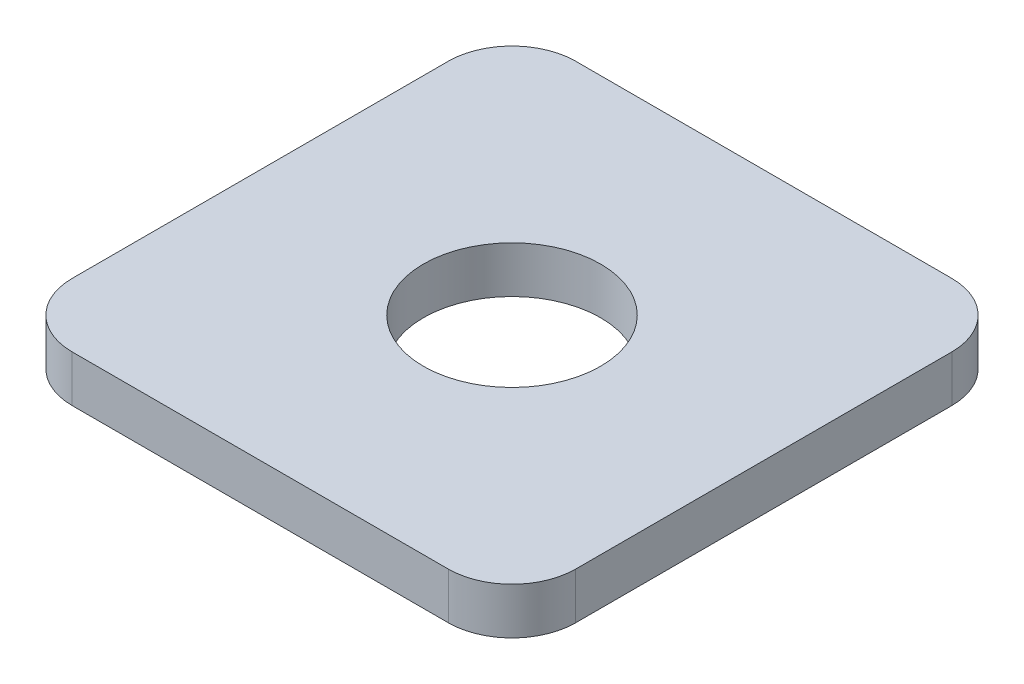
ISO-10303-21;
HEADER;
FILE_DESCRIPTION(('STEP AP214'),'2;1');
FILE_NAME('part.step','',(''),(''),'','','');
FILE_SCHEMA(('AUTOMOTIVE_DESIGN { 1 0 10303 214 1 1 1 1 }'));
ENDSEC;
DATA;
#1=APPLICATION_CONTEXT('core data for automotive mechanical design processes');
#2=APPLICATION_PROTOCOL_DEFINITION('international standard','automotive_design',2000,#1);
#3=PRODUCT_CONTEXT('',#1,'mechanical');
#4=PRODUCT('Part','Part','',(#3));
#5=PRODUCT_RELATED_PRODUCT_CATEGORY('part','',(#4));
#6=PRODUCT_DEFINITION_FORMATION('','',#4);
#7=PRODUCT_DEFINITION_CONTEXT('part definition',#1,'design');
#8=PRODUCT_DEFINITION('design','',#6,#7);
#9=PRODUCT_DEFINITION_SHAPE('','',#8);
#10=(LENGTH_UNIT() NAMED_UNIT(*) SI_UNIT(.MILLI.,.METRE.));
#11=(NAMED_UNIT(*) PLANE_ANGLE_UNIT() SI_UNIT($,.RADIAN.));
#12=(NAMED_UNIT(*) SI_UNIT($,.STERADIAN.) SOLID_ANGLE_UNIT());
#13=UNCERTAINTY_MEASURE_WITH_UNIT(LENGTH_MEASURE(1.E-05),#10,'distance_accuracy_value','');
#14=(GEOMETRIC_REPRESENTATION_CONTEXT(3) GLOBAL_UNCERTAINTY_ASSIGNED_CONTEXT((#13)) GLOBAL_UNIT_ASSIGNED_CONTEXT((#10,
#11,#12)) REPRESENTATION_CONTEXT('',''));
#15=CARTESIAN_POINT('',(0.,0.,0.));
#16=DIRECTION('',(0.,0.,1.));
#17=DIRECTION('',(1.,0.,0.));
#18=AXIS2_PLACEMENT_3D('',#15,#16,#17);
#19=CARTESIAN_POINT('',(0.,3.65,0.));
#20=DIRECTION('',(0.,1.,0.));
#21=DIRECTION('',(0.,0.,1.));
#22=AXIS2_PLACEMENT_3D('',#19,#20,#21);
#23=PLANE('',#22);
#24=DIRECTION('',(-1.,0.,0.));
#25=VECTOR('',#24,1.);
#26=CARTESIAN_POINT('',(-19.75,3.65,-19.75));
#27=LINE('',#26,#25);
#28=CARTESIAN_POINT('',(14.75,3.65,-19.75));
#29=VERTEX_POINT('',#28);
#30=CARTESIAN_POINT('',(-14.75,3.65,-19.75));
#31=VERTEX_POINT('',#30);
#32=EDGE_CURVE('E138',#29,#31,#27,.T.);
#33=ORIENTED_EDGE('',*,*,#32,.T.);
#34=CARTESIAN_POINT('',(-14.75,3.65,-14.75));
#35=DIRECTION('',(0.,1.,0.));
#36=DIRECTION('',(0.,0.,1.));
#37=AXIS2_PLACEMENT_3D('',#34,#35,#36);
#38=CIRCLE('',#37,5.);
#39=CARTESIAN_POINT('',(-19.75,3.65,-14.75));
#40=VERTEX_POINT('',#39);
#41=EDGE_CURVE('E156',#31,#40,#38,.T.);
#42=ORIENTED_EDGE('',*,*,#41,.T.);
#43=DIRECTION('',(0.,0.,1.));
#44=VECTOR('',#43,1.);
#45=CARTESIAN_POINT('',(-19.75,3.65,-19.75));
#46=LINE('',#45,#44);
#47=CARTESIAN_POINT('',(-19.75,3.65,14.75));
#48=VERTEX_POINT('',#47);
#49=EDGE_CURVE('E120',#40,#48,#46,.T.);
#50=ORIENTED_EDGE('',*,*,#49,.T.);
#51=CARTESIAN_POINT('',(-14.75,3.65,14.75));
#52=DIRECTION('',(0.,1.,0.));
#53=DIRECTION('',(0.,0.,1.));
#54=AXIS2_PLACEMENT_3D('',#51,#52,#53);
#55=CIRCLE('',#54,5.);
#56=CARTESIAN_POINT('',(-14.75,3.65,19.75));
#57=VERTEX_POINT('',#56);
#58=EDGE_CURVE('E152',#48,#57,#55,.T.);
#59=ORIENTED_EDGE('',*,*,#58,.T.);
#60=DIRECTION('',(1.,0.,0.));
#61=VECTOR('',#60,1.);
#62=CARTESIAN_POINT('',(-19.75,3.65,19.75));
#63=LINE('',#62,#61);
#64=CARTESIAN_POINT('',(14.75,3.65,19.75));
#65=VERTEX_POINT('',#64);
#66=EDGE_CURVE('E165',#57,#65,#63,.T.);
#67=ORIENTED_EDGE('',*,*,#66,.T.);
#68=CARTESIAN_POINT('',(14.75,3.65,14.75));
#69=DIRECTION('',(0.,1.,0.));
#70=DIRECTION('',(0.,0.,1.));
#71=AXIS2_PLACEMENT_3D('',#68,#69,#70);
#72=CIRCLE('',#71,5.);
#73=CARTESIAN_POINT('',(19.75,3.65,14.75));
#74=VERTEX_POINT('',#73);
#75=EDGE_CURVE('E55',#65,#74,#72,.T.);
#76=ORIENTED_EDGE('',*,*,#75,.T.);
#77=DIRECTION('',(0.,0.,-1.));
#78=VECTOR('',#77,1.);
#79=CARTESIAN_POINT('',(19.75,3.65,-19.75));
#80=LINE('',#79,#78);
#81=CARTESIAN_POINT('',(19.75,3.65,-14.75));
#82=VERTEX_POINT('',#81);
#83=EDGE_CURVE('E171',#74,#82,#80,.T.);
#84=ORIENTED_EDGE('',*,*,#83,.T.);
#85=CARTESIAN_POINT('',(14.75,3.65,-14.75));
#86=DIRECTION('',(0.,1.,0.));
#87=DIRECTION('',(0.,0.,1.));
#88=AXIS2_PLACEMENT_3D('',#85,#86,#87);
#89=CIRCLE('',#88,5.);
#90=EDGE_CURVE('E154',#82,#29,#89,.T.);
#91=ORIENTED_EDGE('',*,*,#90,.T.);
#92=EDGE_LOOP('',(#33,#42,#50,#59,#67,#76,#84,#91));
#93=FACE_BOUND('',#92,.T.);
#94=CARTESIAN_POINT('',(0.,3.65,0.));
#95=DIRECTION('',(0.,1.,0.));
#96=DIRECTION('',(0.,0.,1.));
#97=AXIS2_PLACEMENT_3D('',#94,#95,#96);
#98=CIRCLE('',#97,6.95);
#99=CARTESIAN_POINT('',(0.,3.65,6.95));
#100=VERTEX_POINT('',#99);
#101=EDGE_CURVE('E129',#100,#100,#98,.T.);
#102=ORIENTED_EDGE('',*,*,#101,.F.);
#103=EDGE_LOOP('',(#102));
#104=FACE_BOUND('',#103,.T.);
#105=ADVANCED_FACE('F33',(#93,#104),#23,.T.);
#106=CARTESIAN_POINT('',(0.,0.,0.));
#107=DIRECTION('',(0.,1.,0.));
#108=DIRECTION('',(0.,0.,1.));
#109=AXIS2_PLACEMENT_3D('',#106,#107,#108);
#110=PLANE('',#109);
#111=DIRECTION('',(0.,0.,1.));
#112=VECTOR('',#111,1.);
#113=CARTESIAN_POINT('',(-19.75,0.,-19.75));
#114=LINE('',#113,#112);
#115=CARTESIAN_POINT('',(-19.75,0.,-14.75));
#116=VERTEX_POINT('',#115);
#117=CARTESIAN_POINT('',(-19.75,0.,14.75));
#118=VERTEX_POINT('',#117);
#119=EDGE_CURVE('E117',#116,#118,#114,.T.);
#120=ORIENTED_EDGE('',*,*,#119,.F.);
#121=CARTESIAN_POINT('',(-14.75,0.,-14.75));
#122=DIRECTION('',(0.,1.,0.));
#123=DIRECTION('',(0.,0.,1.));
#124=AXIS2_PLACEMENT_3D('',#121,#122,#123);
#125=CIRCLE('',#124,5.);
#126=CARTESIAN_POINT('',(-14.75,0.,-19.75));
#127=VERTEX_POINT('',#126);
#128=EDGE_CURVE('E100',#116,#127,#125,.F.);
#129=ORIENTED_EDGE('',*,*,#128,.T.);
#130=DIRECTION('',(-1.,0.,0.));
#131=VECTOR('',#130,1.);
#132=CARTESIAN_POINT('',(-19.75,0.,-19.75));
#133=LINE('',#132,#131);
#134=CARTESIAN_POINT('',(14.75,0.,-19.75));
#135=VERTEX_POINT('',#134);
#136=EDGE_CURVE('E142',#135,#127,#133,.T.);
#137=ORIENTED_EDGE('',*,*,#136,.F.);
#138=CARTESIAN_POINT('',(14.75,0.,-14.75));
#139=DIRECTION('',(0.,1.,0.));
#140=DIRECTION('',(0.,0.,1.));
#141=AXIS2_PLACEMENT_3D('',#138,#139,#140);
#142=CIRCLE('',#141,5.);
#143=CARTESIAN_POINT('',(19.75,0.,-14.75));
#144=VERTEX_POINT('',#143);
#145=EDGE_CURVE('E111',#135,#144,#142,.F.);
#146=ORIENTED_EDGE('',*,*,#145,.T.);
#147=DIRECTION('',(0.,0.,-1.));
#148=VECTOR('',#147,1.);
#149=CARTESIAN_POINT('',(19.75,0.,-19.75));
#150=LINE('',#149,#148);
#151=CARTESIAN_POINT('',(19.75,0.,14.75));
#152=VERTEX_POINT('',#151);
#153=EDGE_CURVE('E132',#152,#144,#150,.T.);
#154=ORIENTED_EDGE('',*,*,#153,.F.);
#155=CARTESIAN_POINT('',(14.75,0.,14.75));
#156=DIRECTION('',(0.,1.,0.));
#157=DIRECTION('',(0.,0.,1.));
#158=AXIS2_PLACEMENT_3D('',#155,#156,#157);
#159=CIRCLE('',#158,5.);
#160=CARTESIAN_POINT('',(14.75,0.,19.75));
#161=VERTEX_POINT('',#160);
#162=EDGE_CURVE('E121',#152,#161,#159,.F.);
#163=ORIENTED_EDGE('',*,*,#162,.T.);
#164=DIRECTION('',(1.,0.,0.));
#165=VECTOR('',#164,1.);
#166=CARTESIAN_POINT('',(-19.75,0.,19.75));
#167=LINE('',#166,#165);
#168=CARTESIAN_POINT('',(-14.75,0.,19.75));
#169=VERTEX_POINT('',#168);
#170=EDGE_CURVE('E128',#169,#161,#167,.T.);
#171=ORIENTED_EDGE('',*,*,#170,.F.);
#172=CARTESIAN_POINT('',(-14.75,0.,14.75));
#173=DIRECTION('',(0.,1.,0.));
#174=DIRECTION('',(0.,0.,1.));
#175=AXIS2_PLACEMENT_3D('',#172,#173,#174);
#176=CIRCLE('',#175,5.);
#177=EDGE_CURVE('E127',#169,#118,#176,.F.);
#178=ORIENTED_EDGE('',*,*,#177,.T.);
#179=EDGE_LOOP('',(#120,#129,#137,#146,#154,#163,#171,#178));
#180=FACE_BOUND('',#179,.T.);
#181=CARTESIAN_POINT('',(0.,0.,0.));
#182=DIRECTION('',(0.,1.,0.));
#183=DIRECTION('',(0.,0.,1.));
#184=AXIS2_PLACEMENT_3D('',#181,#182,#183);
#185=CIRCLE('',#184,6.95);
#186=CARTESIAN_POINT('',(0.,0.,6.95));
#187=VERTEX_POINT('',#186);
#188=EDGE_CURVE('E135',#187,#187,#185,.T.);
#189=ORIENTED_EDGE('',*,*,#188,.T.);
#190=EDGE_LOOP('',(#189));
#191=FACE_BOUND('',#190,.T.);
#192=ADVANCED_FACE('F124',(#180,#191),#110,.F.);
#193=CARTESIAN_POINT('',(-19.75,3.65,-19.75));
#194=DIRECTION('',(1.,0.,0.));
#195=DIRECTION('',(0.,0.,-1.));
#196=AXIS2_PLACEMENT_3D('',#193,#194,#195);
#197=PLANE('',#196);
#198=ORIENTED_EDGE('',*,*,#49,.F.);
#199=DIRECTION('',(0.,-1.,0.));
#200=VECTOR('',#199,1.);
#201=CARTESIAN_POINT('',(-19.75,3.65,-14.75));
#202=LINE('',#201,#200);
#203=EDGE_CURVE('E104',#40,#116,#202,.T.);
#204=ORIENTED_EDGE('',*,*,#203,.T.);
#205=ORIENTED_EDGE('',*,*,#119,.T.);
#206=DIRECTION('',(0.,-1.,0.));
#207=VECTOR('',#206,1.);
#208=CARTESIAN_POINT('',(-19.75,3.65,14.75));
#209=LINE('',#208,#207);
#210=EDGE_CURVE('E122',#118,#48,#209,.F.);
#211=ORIENTED_EDGE('',*,*,#210,.T.);
#212=EDGE_LOOP('',(#198,#204,#205,#211));
#213=FACE_BOUND('',#212,.T.);
#214=ADVANCED_FACE('F116',(#213),#197,.F.);
#215=CARTESIAN_POINT('',(-19.75,3.65,19.75));
#216=DIRECTION('',(0.,0.,-1.));
#217=DIRECTION('',(-1.,0.,0.));
#218=AXIS2_PLACEMENT_3D('',#215,#216,#217);
#219=PLANE('',#218);
#220=ORIENTED_EDGE('',*,*,#66,.F.);
#221=DIRECTION('',(0.,-1.,0.));
#222=VECTOR('',#221,1.);
#223=CARTESIAN_POINT('',(-14.75,3.65,19.75));
#224=LINE('',#223,#222);
#225=EDGE_CURVE('E11',#57,#169,#224,.T.);
#226=ORIENTED_EDGE('',*,*,#225,.T.);
#227=ORIENTED_EDGE('',*,*,#170,.T.);
#228=DIRECTION('',(0.,-1.,0.));
#229=VECTOR('',#228,1.);
#230=CARTESIAN_POINT('',(14.75,3.65,19.75));
#231=LINE('',#230,#229);
#232=EDGE_CURVE('E41',#161,#65,#231,.F.);
#233=ORIENTED_EDGE('',*,*,#232,.T.);
#234=EDGE_LOOP('',(#220,#226,#227,#233));
#235=FACE_BOUND('',#234,.T.);
#236=ADVANCED_FACE('F164',(#235),#219,.F.);
#237=CARTESIAN_POINT('',(19.75,3.65,-19.75));
#238=DIRECTION('',(-1.,0.,0.));
#239=DIRECTION('',(0.,0.,1.));
#240=AXIS2_PLACEMENT_3D('',#237,#238,#239);
#241=PLANE('',#240);
#242=ORIENTED_EDGE('',*,*,#153,.T.);
#243=DIRECTION('',(0.,-1.,0.));
#244=VECTOR('',#243,1.);
#245=CARTESIAN_POINT('',(19.75,3.65,-14.75));
#246=LINE('',#245,#244);
#247=EDGE_CURVE('E48',#144,#82,#246,.F.);
#248=ORIENTED_EDGE('',*,*,#247,.T.);
#249=ORIENTED_EDGE('',*,*,#83,.F.);
#250=DIRECTION('',(0.,-1.,0.));
#251=VECTOR('',#250,1.);
#252=CARTESIAN_POINT('',(19.75,3.65,14.75));
#253=LINE('',#252,#251);
#254=EDGE_CURVE('E158',#74,#152,#253,.T.);
#255=ORIENTED_EDGE('',*,*,#254,.T.);
#256=EDGE_LOOP('',(#242,#248,#249,#255));
#257=FACE_BOUND('',#256,.T.);
#258=ADVANCED_FACE('F175',(#257),#241,.F.);
#259=CARTESIAN_POINT('',(-19.75,3.65,-19.75));
#260=DIRECTION('',(0.,0.,1.));
#261=DIRECTION('',(1.,0.,0.));
#262=AXIS2_PLACEMENT_3D('',#259,#260,#261);
#263=PLANE('',#262);
#264=ORIENTED_EDGE('',*,*,#136,.T.);
#265=DIRECTION('',(0.,-1.,0.));
#266=VECTOR('',#265,1.);
#267=CARTESIAN_POINT('',(-14.75,3.65,-19.75));
#268=LINE('',#267,#266);
#269=EDGE_CURVE('E105',#127,#31,#268,.F.);
#270=ORIENTED_EDGE('',*,*,#269,.T.);
#271=ORIENTED_EDGE('',*,*,#32,.F.);
#272=DIRECTION('',(0.,-1.,0.));
#273=VECTOR('',#272,1.);
#274=CARTESIAN_POINT('',(14.75,3.65,-19.75));
#275=LINE('',#274,#273);
#276=EDGE_CURVE('E110',#29,#135,#275,.T.);
#277=ORIENTED_EDGE('',*,*,#276,.T.);
#278=EDGE_LOOP('',(#264,#270,#271,#277));
#279=FACE_BOUND('',#278,.T.);
#280=ADVANCED_FACE('F182',(#279),#263,.F.);
#281=CARTESIAN_POINT('',(0.,3.65,0.));
#282=DIRECTION('',(0.,-1.,0.));
#283=DIRECTION('',(0.,0.,-1.));
#284=AXIS2_PLACEMENT_3D('',#281,#282,#283);
#285=CYLINDRICAL_SURFACE('',#284,6.95);
#286=ORIENTED_EDGE('',*,*,#101,.T.);
#287=EDGE_LOOP('',(#286));
#288=FACE_BOUND('',#287,.T.);
#289=ORIENTED_EDGE('',*,*,#188,.F.);
#290=EDGE_LOOP('',(#289));
#291=FACE_BOUND('',#290,.T.);
#292=ADVANCED_FACE('F188',(#288,#291),#285,.F.);
#293=CARTESIAN_POINT('',(-14.75,3.65,-14.75));
#294=DIRECTION('',(0.,-1.,0.));
#295=DIRECTION('',(0.,0.,-1.));
#296=AXIS2_PLACEMENT_3D('',#293,#294,#295);
#297=CYLINDRICAL_SURFACE('',#296,5.);
#298=ORIENTED_EDGE('',*,*,#41,.F.);
#299=ORIENTED_EDGE('',*,*,#269,.F.);
#300=ORIENTED_EDGE('',*,*,#128,.F.);
#301=ORIENTED_EDGE('',*,*,#203,.F.);
#302=EDGE_LOOP('',(#298,#299,#300,#301));
#303=FACE_BOUND('',#302,.T.);
#304=ADVANCED_FACE('F103',(#303),#297,.T.);
#305=CARTESIAN_POINT('',(14.75,3.65,-14.75));
#306=DIRECTION('',(0.,-1.,0.));
#307=DIRECTION('',(0.,0.,-1.));
#308=AXIS2_PLACEMENT_3D('',#305,#306,#307);
#309=CYLINDRICAL_SURFACE('',#308,5.);
#310=ORIENTED_EDGE('',*,*,#90,.F.);
#311=ORIENTED_EDGE('',*,*,#247,.F.);
#312=ORIENTED_EDGE('',*,*,#145,.F.);
#313=ORIENTED_EDGE('',*,*,#276,.F.);
#314=EDGE_LOOP('',(#310,#311,#312,#313));
#315=FACE_BOUND('',#314,.T.);
#316=ADVANCED_FACE('F179',(#315),#309,.T.);
#317=CARTESIAN_POINT('',(-14.75,3.65,14.75));
#318=DIRECTION('',(0.,-1.,0.));
#319=DIRECTION('',(0.,0.,-1.));
#320=AXIS2_PLACEMENT_3D('',#317,#318,#319);
#321=CYLINDRICAL_SURFACE('',#320,5.);
#322=ORIENTED_EDGE('',*,*,#58,.F.);
#323=ORIENTED_EDGE('',*,*,#210,.F.);
#324=ORIENTED_EDGE('',*,*,#177,.F.);
#325=ORIENTED_EDGE('',*,*,#225,.F.);
#326=EDGE_LOOP('',(#322,#323,#324,#325));
#327=FACE_BOUND('',#326,.T.);
#328=ADVANCED_FACE('F212',(#327),#321,.T.);
#329=CARTESIAN_POINT('',(14.75,3.65,14.75));
#330=DIRECTION('',(0.,-1.,0.));
#331=DIRECTION('',(0.,0.,-1.));
#332=AXIS2_PLACEMENT_3D('',#329,#330,#331);
#333=CYLINDRICAL_SURFACE('',#332,5.);
#334=ORIENTED_EDGE('',*,*,#75,.F.);
#335=ORIENTED_EDGE('',*,*,#232,.F.);
#336=ORIENTED_EDGE('',*,*,#162,.F.);
#337=ORIENTED_EDGE('',*,*,#254,.F.);
#338=EDGE_LOOP('',(#334,#335,#336,#337));
#339=FACE_BOUND('',#338,.T.);
#340=ADVANCED_FACE('F35',(#339),#333,.T.);
#341=CLOSED_SHELL('',(#105,#192,#214,#236,#258,#280,#292,#304,#316,#328,#340));
#342=MANIFOLD_SOLID_BREP('B2',#341);
#343=ADVANCED_BREP_SHAPE_REPRESENTATION('',(#18,#342),#14);
#344=SHAPE_DEFINITION_REPRESENTATION(#9,#343);
ENDSEC;
END-ISO-10303-21;
